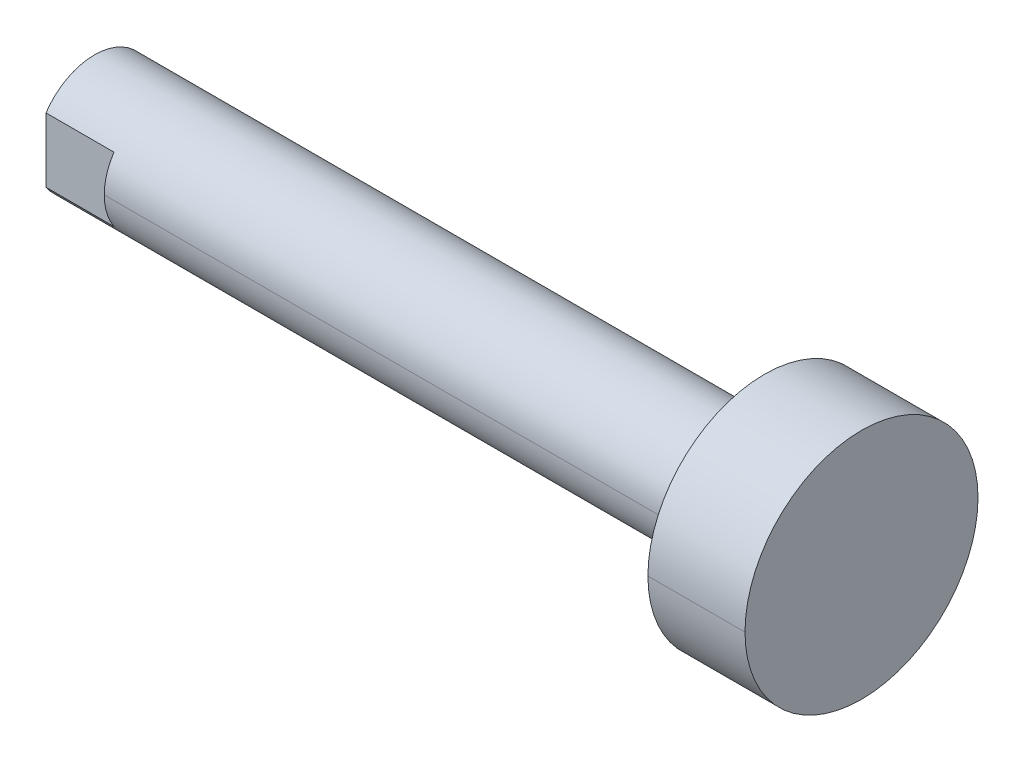
ISO-10303-21;
HEADER;
FILE_DESCRIPTION(('STEP AP214'),'2;1');
FILE_NAME('part.step','',(''),(''),'','','');
FILE_SCHEMA(('AUTOMOTIVE_DESIGN { 1 0 10303 214 1 1 1 1 }'));
ENDSEC;
DATA;
#1=APPLICATION_CONTEXT('core data for automotive mechanical design processes');
#2=APPLICATION_PROTOCOL_DEFINITION('international standard','automotive_design',2000,#1);
#3=PRODUCT_CONTEXT('',#1,'mechanical');
#4=PRODUCT('Part','Part','',(#3));
#5=PRODUCT_RELATED_PRODUCT_CATEGORY('part','',(#4));
#6=PRODUCT_DEFINITION_FORMATION('','',#4);
#7=PRODUCT_DEFINITION_CONTEXT('part definition',#1,'design');
#8=PRODUCT_DEFINITION('design','',#6,#7);
#9=PRODUCT_DEFINITION_SHAPE('','',#8);
#10=(LENGTH_UNIT() NAMED_UNIT(*) SI_UNIT(.MILLI.,.METRE.));
#11=(NAMED_UNIT(*) PLANE_ANGLE_UNIT() SI_UNIT($,.RADIAN.));
#12=(NAMED_UNIT(*) SI_UNIT($,.STERADIAN.) SOLID_ANGLE_UNIT());
#13=UNCERTAINTY_MEASURE_WITH_UNIT(LENGTH_MEASURE(1.E-05),#10,'distance_accuracy_value','');
#14=(GEOMETRIC_REPRESENTATION_CONTEXT(3) GLOBAL_UNCERTAINTY_ASSIGNED_CONTEXT((#13)) GLOBAL_UNIT_ASSIGNED_CONTEXT((#10,
#11,#12)) REPRESENTATION_CONTEXT('',''));
#15=CARTESIAN_POINT('',(0.,0.,0.));
#16=DIRECTION('',(0.,0.,1.));
#17=DIRECTION('',(1.,0.,0.));
#18=AXIS2_PLACEMENT_3D('',#15,#16,#17);
#19=CARTESIAN_POINT('',(-3.5,0.,0.));
#20=DIRECTION('',(1.,0.,0.));
#21=DIRECTION('',(0.,0.,-1.));
#22=AXIS2_PLACEMENT_3D('',#19,#20,#21);
#23=PLANE('',#22);
#24=CARTESIAN_POINT('',(-3.5,0.,0.));
#25=DIRECTION('',(1.,0.,0.));
#26=DIRECTION('',(0.,0.,-1.));
#27=AXIS2_PLACEMENT_3D('',#24,#25,#26);
#28=CIRCLE('',#27,3.);
#29=CARTESIAN_POINT('',(-3.5,1.6583123951777,-2.5));
#30=VERTEX_POINT('',#29);
#31=CARTESIAN_POINT('',(-3.5,1.6583123951777,2.5));
#32=VERTEX_POINT('',#31);
#33=EDGE_CURVE('E11',#30,#32,#28,.T.);
#34=ORIENTED_EDGE('',*,*,#33,.F.);
#35=DIRECTION('',(0.,1.,0.));
#36=VECTOR('',#35,1.);
#37=CARTESIAN_POINT('',(-3.5,-4.,-2.5));
#38=LINE('',#37,#36);
#39=CARTESIAN_POINT('',(-3.5,-1.6583123951777,-2.5));
#40=VERTEX_POINT('',#39);
#41=EDGE_CURVE('E25',#40,#30,#38,.T.);
#42=ORIENTED_EDGE('',*,*,#41,.F.);
#43=CARTESIAN_POINT('',(-3.5,0.,0.));
#44=DIRECTION('',(1.,0.,0.));
#45=DIRECTION('',(0.,0.,-1.));
#46=AXIS2_PLACEMENT_3D('',#43,#44,#45);
#47=CIRCLE('',#46,3.);
#48=CARTESIAN_POINT('',(-3.5,-1.6583123951777,2.5));
#49=VERTEX_POINT('',#48);
#50=EDGE_CURVE('E259',#49,#40,#47,.T.);
#51=ORIENTED_EDGE('',*,*,#50,.F.);
#52=DIRECTION('',(0.,-1.,0.));
#53=VECTOR('',#52,1.);
#54=CARTESIAN_POINT('',(-3.5,4.,2.5));
#55=LINE('',#54,#53);
#56=EDGE_CURVE('E254',#32,#49,#55,.T.);
#57=ORIENTED_EDGE('',*,*,#56,.F.);
#58=EDGE_LOOP('',(#34,#42,#51,#57));
#59=FACE_BOUND('',#58,.T.);
#60=CARTESIAN_POINT('',(-3.5,0.,0.));
#61=DIRECTION('',(1.,0.,0.));
#62=DIRECTION('',(0.,0.,-1.));
#63=AXIS2_PLACEMENT_3D('',#60,#61,#62);
#64=CIRCLE('',#63,1.5);
#65=CARTESIAN_POINT('',(-3.5,0.,-1.4999999999999));
#66=VERTEX_POINT('',#65);
#67=CARTESIAN_POINT('',(-3.5,0.,1.5));
#68=VERTEX_POINT('',#67);
#69=EDGE_CURVE('E250',#66,#68,#64,.T.);
#70=ORIENTED_EDGE('',*,*,#69,.T.);
#71=CARTESIAN_POINT('',(-3.5,0.,0.));
#72=DIRECTION('',(1.,0.,0.));
#73=DIRECTION('',(0.,0.,-1.));
#74=AXIS2_PLACEMENT_3D('',#71,#72,#73);
#75=CIRCLE('',#74,1.5);
#76=EDGE_CURVE('E246',#68,#66,#75,.T.);
#77=ORIENTED_EDGE('',*,*,#76,.T.);
#78=EDGE_LOOP('',(#70,#77));
#79=FACE_BOUND('',#78,.T.);
#80=ADVANCED_FACE('F17',(#59,#79),#23,.F.);
#81=CARTESIAN_POINT('',(-3.5,0.,0.));
#82=DIRECTION('',(-1.,0.,0.));
#83=DIRECTION('',(0.,1.,0.));
#84=AXIS2_PLACEMENT_3D('',#81,#82,#83);
#85=CONICAL_SURFACE('',#84,1.5,0.7853981634);
#86=ORIENTED_EDGE('',*,*,#76,.F.);
#87=DIRECTION('',(-0.707106781184744,0.,0.707106781188351));
#88=VECTOR('',#87,1.);
#89=CARTESIAN_POINT('',(-3.22950000000074,0.,1.22949999999936));
#90=LINE('',#89,#88);
#91=CARTESIAN_POINT('',(-3.22950000000074,0.,1.22949999999936));
#92=VERTEX_POINT('',#91);
#93=EDGE_CURVE('E241',#92,#68,#90,.T.);
#94=ORIENTED_EDGE('',*,*,#93,.F.);
#95=CARTESIAN_POINT('',(-3.2295000000001,0.,0.));
#96=DIRECTION('',(1.,0.,0.));
#97=DIRECTION('',(0.,0.,-1.));
#98=AXIS2_PLACEMENT_3D('',#95,#96,#97);
#99=CIRCLE('',#98,1.2295);
#100=CARTESIAN_POINT('',(-3.2295000000001,0.,-1.2295));
#101=VERTEX_POINT('',#100);
#102=EDGE_CURVE('E237',#92,#101,#99,.T.);
#103=ORIENTED_EDGE('',*,*,#102,.T.);
#104=DIRECTION('',(-0.707106781184744,0.,-0.707106781188351));
#105=VECTOR('',#104,1.);
#106=CARTESIAN_POINT('',(-3.22950000000074,0.,-1.22949999999936));
#107=LINE('',#106,#105);
#108=EDGE_CURVE('E232',#101,#66,#107,.T.);
#109=ORIENTED_EDGE('',*,*,#108,.T.);
#110=EDGE_LOOP('',(#86,#94,#103,#109));
#111=FACE_BOUND('',#110,.T.);
#112=ADVANCED_FACE('F295',(#111),#85,.F.);
#113=CARTESIAN_POINT('',(-3.5,0.,0.));
#114=DIRECTION('',(-1.,0.,0.));
#115=DIRECTION('',(0.,-1.,0.));
#116=AXIS2_PLACEMENT_3D('',#113,#114,#115);
#117=CONICAL_SURFACE('',#116,1.5,0.7853981634);
#118=CARTESIAN_POINT('',(-3.2295000000001,0.,0.));
#119=DIRECTION('',(1.,0.,0.));
#120=DIRECTION('',(0.,0.,-1.));
#121=AXIS2_PLACEMENT_3D('',#118,#119,#120);
#122=CIRCLE('',#121,1.2295);
#123=EDGE_CURVE('E227',#101,#92,#122,.T.);
#124=ORIENTED_EDGE('',*,*,#123,.T.);
#125=ORIENTED_EDGE('',*,*,#93,.T.);
#126=ORIENTED_EDGE('',*,*,#69,.F.);
#127=ORIENTED_EDGE('',*,*,#108,.F.);
#128=EDGE_LOOP('',(#124,#125,#126,#127));
#129=FACE_BOUND('',#128,.T.);
#130=ADVANCED_FACE('F299',(#129),#117,.F.);
#131=CARTESIAN_POINT('',(3.2098521559686,0.,0.));
#132=DIRECTION('',(-1.,0.,0.));
#133=DIRECTION('',(0.,-1.,0.));
#134=AXIS2_PLACEMENT_3D('',#131,#132,#133);
#135=CYLINDRICAL_SURFACE('',#134,1.2295);
#136=CARTESIAN_POINT('',(2.5,0.,0.));
#137=DIRECTION('',(1.,0.,0.));
#138=DIRECTION('',(0.,0.,-1.));
#139=AXIS2_PLACEMENT_3D('',#136,#137,#138);
#140=CIRCLE('',#139,1.2295);
#141=CARTESIAN_POINT('',(2.5,0.,-1.2295));
#142=VERTEX_POINT('',#141);
#143=CARTESIAN_POINT('',(2.5,0.,1.2295));
#144=VERTEX_POINT('',#143);
#145=EDGE_CURVE('E223',#142,#144,#140,.T.);
#146=ORIENTED_EDGE('',*,*,#145,.T.);
#147=DIRECTION('',(-1.,0.,0.));
#148=VECTOR('',#147,1.);
#149=CARTESIAN_POINT('',(2.5,0.,1.2295));
#150=LINE('',#149,#148);
#151=EDGE_CURVE('E218',#144,#92,#150,.T.);
#152=ORIENTED_EDGE('',*,*,#151,.T.);
#153=ORIENTED_EDGE('',*,*,#123,.F.);
#154=DIRECTION('',(-1.,0.,0.));
#155=VECTOR('',#154,1.);
#156=CARTESIAN_POINT('',(2.5,0.,-1.2295));
#157=LINE('',#156,#155);
#158=EDGE_CURVE('E213',#142,#101,#157,.T.);
#159=ORIENTED_EDGE('',*,*,#158,.F.);
#160=EDGE_LOOP('',(#146,#152,#153,#159));
#161=FACE_BOUND('',#160,.T.);
#162=ADVANCED_FACE('F310',(#161),#135,.F.);
#163=CARTESIAN_POINT('',(3.2098521559686,0.,0.));
#164=DIRECTION('',(-1.,0.,0.));
#165=DIRECTION('',(0.,1.,0.));
#166=AXIS2_PLACEMENT_3D('',#163,#164,#165);
#167=CYLINDRICAL_SURFACE('',#166,1.2295);
#168=ORIENTED_EDGE('',*,*,#102,.F.);
#169=ORIENTED_EDGE('',*,*,#151,.F.);
#170=CARTESIAN_POINT('',(2.5,0.,0.));
#171=DIRECTION('',(1.,0.,0.));
#172=DIRECTION('',(0.,0.,-1.));
#173=AXIS2_PLACEMENT_3D('',#170,#171,#172);
#174=CIRCLE('',#173,1.2295);
#175=EDGE_CURVE('E208',#144,#142,#174,.T.);
#176=ORIENTED_EDGE('',*,*,#175,.T.);
#177=ORIENTED_EDGE('',*,*,#158,.T.);
#178=EDGE_LOOP('',(#168,#169,#176,#177));
#179=FACE_BOUND('',#178,.T.);
#180=ADVANCED_FACE('F314',(#179),#167,.F.);
#181=CARTESIAN_POINT('',(2.5,0.,0.));
#182=DIRECTION('',(-1.,0.,0.));
#183=DIRECTION('',(0.,1.,0.));
#184=AXIS2_PLACEMENT_3D('',#181,#182,#183);
#185=CONICAL_SURFACE('',#184,1.2295,1.0471975512);
#186=DIRECTION('',(-0.499999999997054,0.,-0.86602540378614));
#187=VECTOR('',#186,1.);
#188=CARTESIAN_POINT('',(3.20985215596307,0.,0.));
#189=LINE('',#188,#187);
#190=CARTESIAN_POINT('',(3.2098521559686,0.,0.));
#191=VERTEX_POINT('',#190);
#192=EDGE_CURVE('E203',#191,#142,#189,.T.);
#193=ORIENTED_EDGE('',*,*,#192,.T.);
#194=ORIENTED_EDGE('',*,*,#175,.F.);
#195=DIRECTION('',(-0.499999999997054,0.,0.86602540378614));
#196=VECTOR('',#195,1.);
#197=CARTESIAN_POINT('',(3.20985215596307,0.,0.));
#198=LINE('',#197,#196);
#199=EDGE_CURVE('E198',#191,#144,#198,.T.);
#200=ORIENTED_EDGE('',*,*,#199,.F.);
#201=EDGE_LOOP('',(#193,#194,#200));
#202=FACE_BOUND('',#201,.T.);
#203=ADVANCED_FACE('F317',(#202),#185,.F.);
#204=CARTESIAN_POINT('',(2.5,0.,0.));
#205=DIRECTION('',(-1.,0.,0.));
#206=DIRECTION('',(0.,-1.,0.));
#207=AXIS2_PLACEMENT_3D('',#204,#205,#206);
#208=CONICAL_SURFACE('',#207,1.2295,1.0471975512);
#209=ORIENTED_EDGE('',*,*,#199,.T.);
#210=ORIENTED_EDGE('',*,*,#145,.F.);
#211=ORIENTED_EDGE('',*,*,#192,.F.);
#212=EDGE_LOOP('',(#209,#210,#211));
#213=FACE_BOUND('',#212,.T.);
#214=ADVANCED_FACE('F319',(#213),#208,.F.);
#215=CARTESIAN_POINT('',(-3.5,4.,2.5));
#216=DIRECTION('',(0.,0.,1.));
#217=DIRECTION('',(1.,0.,0.));
#218=AXIS2_PLACEMENT_3D('',#215,#216,#217);
#219=PLANE('',#218);
#220=DIRECTION('',(1.,0.,0.));
#221=VECTOR('',#220,1.);
#222=CARTESIAN_POINT('',(36.,-1.6583123951777,2.5));
#223=LINE('',#222,#221);
#224=CARTESIAN_POINT('',(0.,-1.6583123951777,2.5));
#225=VERTEX_POINT('',#224);
#226=EDGE_CURVE('E194',#49,#225,#223,.T.);
#227=ORIENTED_EDGE('',*,*,#226,.T.);
#228=DIRECTION('',(0.,-1.,0.));
#229=VECTOR('',#228,1.);
#230=CARTESIAN_POINT('',(0.,4.,2.5));
#231=LINE('',#230,#229);
#232=CARTESIAN_POINT('',(0.,1.6583123951777,2.5));
#233=VERTEX_POINT('',#232);
#234=EDGE_CURVE('E189',#233,#225,#231,.T.);
#235=ORIENTED_EDGE('',*,*,#234,.F.);
#236=DIRECTION('',(1.,0.,0.));
#237=VECTOR('',#236,1.);
#238=CARTESIAN_POINT('',(36.,1.6583123951777,2.5));
#239=LINE('',#238,#237);
#240=EDGE_CURVE('E184',#32,#233,#239,.T.);
#241=ORIENTED_EDGE('',*,*,#240,.F.);
#242=ORIENTED_EDGE('',*,*,#56,.T.);
#243=EDGE_LOOP('',(#227,#235,#241,#242));
#244=FACE_BOUND('',#243,.T.);
#245=ADVANCED_FACE('F321',(#244),#219,.T.);
#246=CARTESIAN_POINT('',(36.,0.,0.));
#247=DIRECTION('',(-1.,0.,0.));
#248=DIRECTION('',(0.,-1.,0.));
#249=AXIS2_PLACEMENT_3D('',#246,#247,#248);
#250=CYLINDRICAL_SURFACE('',#249,3.);
#251=CARTESIAN_POINT('',(31.,0.,0.));
#252=DIRECTION('',(1.,0.,0.));
#253=DIRECTION('',(0.,0.,-1.));
#254=AXIS2_PLACEMENT_3D('',#251,#252,#253);
#255=CIRCLE('',#254,3.);
#256=CARTESIAN_POINT('',(31.,0.,-3.));
#257=VERTEX_POINT('',#256);
#258=CARTESIAN_POINT('',(31.,0.,3.));
#259=VERTEX_POINT('',#258);
#260=EDGE_CURVE('E179',#257,#259,#255,.T.);
#261=ORIENTED_EDGE('',*,*,#260,.F.);
#262=DIRECTION('',(-1.,0.,0.));
#263=VECTOR('',#262,1.);
#264=CARTESIAN_POINT('',(31.,0.,-3.));
#265=LINE('',#264,#263);
#266=CARTESIAN_POINT('',(0.,0.,-3.));
#267=VERTEX_POINT('',#266);
#268=EDGE_CURVE('E175',#257,#267,#265,.T.);
#269=ORIENTED_EDGE('',*,*,#268,.T.);
#270=CARTESIAN_POINT('',(0.,0.,0.));
#271=DIRECTION('',(1.,0.,0.));
#272=DIRECTION('',(0.,0.,-1.));
#273=AXIS2_PLACEMENT_3D('',#270,#271,#272);
#274=CIRCLE('',#273,3.);
#275=CARTESIAN_POINT('',(0.,1.6583123951777,-2.5));
#276=VERTEX_POINT('',#275);
#277=EDGE_CURVE('E171',#267,#276,#274,.T.);
#278=ORIENTED_EDGE('',*,*,#277,.T.);
#279=DIRECTION('',(1.,0.,0.));
#280=VECTOR('',#279,1.);
#281=CARTESIAN_POINT('',(36.,1.6583123951777,-2.5));
#282=LINE('',#281,#280);
#283=EDGE_CURVE('E166',#30,#276,#282,.T.);
#284=ORIENTED_EDGE('',*,*,#283,.F.);
#285=ORIENTED_EDGE('',*,*,#33,.T.);
#286=ORIENTED_EDGE('',*,*,#240,.T.);
#287=CARTESIAN_POINT('',(0.,0.,0.));
#288=DIRECTION('',(1.,0.,0.));
#289=DIRECTION('',(0.,0.,-1.));
#290=AXIS2_PLACEMENT_3D('',#287,#288,#289);
#291=CIRCLE('',#290,3.);
#292=CARTESIAN_POINT('',(0.,0.,3.));
#293=VERTEX_POINT('',#292);
#294=EDGE_CURVE('E162',#233,#293,#291,.T.);
#295=ORIENTED_EDGE('',*,*,#294,.T.);
#296=DIRECTION('',(-1.,0.,0.));
#297=VECTOR('',#296,1.);
#298=CARTESIAN_POINT('',(31.,0.,3.));
#299=LINE('',#298,#297);
#300=EDGE_CURVE('E157',#259,#293,#299,.T.);
#301=ORIENTED_EDGE('',*,*,#300,.F.);
#302=EDGE_LOOP('',(#261,#269,#278,#284,#285,#286,#295,#301));
#303=FACE_BOUND('',#302,.T.);
#304=ADVANCED_FACE('F280',(#303),#250,.T.);
#305=CARTESIAN_POINT('',(36.,0.,0.));
#306=DIRECTION('',(-1.,0.,0.));
#307=DIRECTION('',(0.,1.,0.));
#308=AXIS2_PLACEMENT_3D('',#305,#306,#307);
#309=CYLINDRICAL_SURFACE('',#308,3.);
#310=CARTESIAN_POINT('',(0.,0.,0.));
#311=DIRECTION('',(1.,0.,0.));
#312=DIRECTION('',(0.,0.,-1.));
#313=AXIS2_PLACEMENT_3D('',#310,#311,#312);
#314=CIRCLE('',#313,3.);
#315=EDGE_CURVE('E152',#293,#225,#314,.T.);
#316=ORIENTED_EDGE('',*,*,#315,.T.);
#317=ORIENTED_EDGE('',*,*,#226,.F.);
#318=ORIENTED_EDGE('',*,*,#50,.T.);
#319=DIRECTION('',(1.,0.,0.));
#320=VECTOR('',#319,1.);
#321=CARTESIAN_POINT('',(36.,-1.6583123951777,-2.5));
#322=LINE('',#321,#320);
#323=CARTESIAN_POINT('',(0.,-1.6583123951777,-2.5));
#324=VERTEX_POINT('',#323);
#325=EDGE_CURVE('E148',#40,#324,#322,.T.);
#326=ORIENTED_EDGE('',*,*,#325,.T.);
#327=CARTESIAN_POINT('',(0.,0.,0.));
#328=DIRECTION('',(1.,0.,0.));
#329=DIRECTION('',(0.,0.,-1.));
#330=AXIS2_PLACEMENT_3D('',#327,#328,#329);
#331=CIRCLE('',#330,3.);
#332=EDGE_CURVE('E143',#324,#267,#331,.T.);
#333=ORIENTED_EDGE('',*,*,#332,.T.);
#334=ORIENTED_EDGE('',*,*,#268,.F.);
#335=CARTESIAN_POINT('',(31.,0.,0.));
#336=DIRECTION('',(1.,0.,0.));
#337=DIRECTION('',(0.,0.,-1.));
#338=AXIS2_PLACEMENT_3D('',#335,#336,#337);
#339=CIRCLE('',#338,3.);
#340=EDGE_CURVE('E138',#259,#257,#339,.T.);
#341=ORIENTED_EDGE('',*,*,#340,.F.);
#342=ORIENTED_EDGE('',*,*,#300,.T.);
#343=EDGE_LOOP('',(#316,#317,#318,#326,#333,#334,#341,#342));
#344=FACE_BOUND('',#343,.T.);
#345=ADVANCED_FACE('F273',(#344),#309,.T.);
#346=CARTESIAN_POINT('',(31.,3.,0.));
#347=DIRECTION('',(1.,0.,0.));
#348=DIRECTION('',(0.,0.,-1.));
#349=AXIS2_PLACEMENT_3D('',#346,#347,#348);
#350=PLANE('',#349);
#351=CARTESIAN_POINT('',(31.,0.,0.));
#352=DIRECTION('',(1.,0.,0.));
#353=DIRECTION('',(0.,0.,-1.));
#354=AXIS2_PLACEMENT_3D('',#351,#352,#353);
#355=CIRCLE('',#354,6.);
#356=CARTESIAN_POINT('',(31.,0.,-6.));
#357=VERTEX_POINT('',#356);
#358=CARTESIAN_POINT('',(31.,0.,6.));
#359=VERTEX_POINT('',#358);
#360=EDGE_CURVE('E114',#357,#359,#355,.T.);
#361=ORIENTED_EDGE('',*,*,#360,.F.);
#362=CARTESIAN_POINT('',(31.,0.,0.));
#363=DIRECTION('',(1.,0.,0.));
#364=DIRECTION('',(0.,0.,-1.));
#365=AXIS2_PLACEMENT_3D('',#362,#363,#364);
#366=CIRCLE('',#365,6.);
#367=EDGE_CURVE('E131',#359,#357,#366,.T.);
#368=ORIENTED_EDGE('',*,*,#367,.F.);
#369=EDGE_LOOP('',(#361,#368));
#370=FACE_BOUND('',#369,.T.);
#371=ORIENTED_EDGE('',*,*,#260,.T.);
#372=ORIENTED_EDGE('',*,*,#340,.T.);
#373=EDGE_LOOP('',(#371,#372));
#374=FACE_BOUND('',#373,.T.);
#375=ADVANCED_FACE('F283',(#370,#374),#350,.F.);
#376=CARTESIAN_POINT('',(36.,0.,0.));
#377=DIRECTION('',(-1.,0.,0.));
#378=DIRECTION('',(0.,1.,0.));
#379=AXIS2_PLACEMENT_3D('',#376,#377,#378);
#380=CYLINDRICAL_SURFACE('',#379,6.);
#381=ORIENTED_EDGE('',*,*,#367,.T.);
#382=DIRECTION('',(-1.,0.,0.));
#383=VECTOR('',#382,1.);
#384=CARTESIAN_POINT('',(36.,0.,-6.));
#385=LINE('',#384,#383);
#386=CARTESIAN_POINT('',(36.,0.,-6.));
#387=VERTEX_POINT('',#386);
#388=EDGE_CURVE('E106',#387,#357,#385,.T.);
#389=ORIENTED_EDGE('',*,*,#388,.F.);
#390=CARTESIAN_POINT('',(36.,0.,0.));
#391=DIRECTION('',(1.,0.,0.));
#392=DIRECTION('',(0.,0.,-1.));
#393=AXIS2_PLACEMENT_3D('',#390,#391,#392);
#394=CIRCLE('',#393,6.);
#395=CARTESIAN_POINT('',(36.,0.,6.));
#396=VERTEX_POINT('',#395);
#397=EDGE_CURVE('E99',#396,#387,#394,.T.);
#398=ORIENTED_EDGE('',*,*,#397,.F.);
#399=DIRECTION('',(-1.,0.,0.));
#400=VECTOR('',#399,1.);
#401=CARTESIAN_POINT('',(36.,0.,6.));
#402=LINE('',#401,#400);
#403=EDGE_CURVE('E103',#396,#359,#402,.T.);
#404=ORIENTED_EDGE('',*,*,#403,.T.);
#405=EDGE_LOOP('',(#381,#389,#398,#404));
#406=FACE_BOUND('',#405,.T.);
#407=ADVANCED_FACE('F102',(#406),#380,.T.);
#408=CARTESIAN_POINT('',(36.,0.,0.));
#409=DIRECTION('',(-1.,0.,0.));
#410=DIRECTION('',(0.,-1.,0.));
#411=AXIS2_PLACEMENT_3D('',#408,#409,#410);
#412=CYLINDRICAL_SURFACE('',#411,6.);
#413=CARTESIAN_POINT('',(36.,0.,0.));
#414=DIRECTION('',(1.,0.,0.));
#415=DIRECTION('',(0.,0.,-1.));
#416=AXIS2_PLACEMENT_3D('',#413,#414,#415);
#417=CIRCLE('',#416,6.);
#418=EDGE_CURVE('E113',#387,#396,#417,.T.);
#419=ORIENTED_EDGE('',*,*,#418,.F.);
#420=ORIENTED_EDGE('',*,*,#388,.T.);
#421=ORIENTED_EDGE('',*,*,#360,.T.);
#422=ORIENTED_EDGE('',*,*,#403,.F.);
#423=EDGE_LOOP('',(#419,#420,#421,#422));
#424=FACE_BOUND('',#423,.T.);
#425=ADVANCED_FACE('F112',(#424),#412,.T.);
#426=CARTESIAN_POINT('',(36.,6.,0.));
#427=DIRECTION('',(-1.,0.,0.));
#428=DIRECTION('',(0.,0.,1.));
#429=AXIS2_PLACEMENT_3D('',#426,#427,#428);
#430=PLANE('',#429);
#431=ORIENTED_EDGE('',*,*,#418,.T.);
#432=ORIENTED_EDGE('',*,*,#397,.T.);
#433=EDGE_LOOP('',(#431,#432));
#434=FACE_BOUND('',#433,.T.);
#435=ADVANCED_FACE('F116',(#434),#430,.F.);
#436=CARTESIAN_POINT('',(0.,0.,0.));
#437=DIRECTION('',(1.,0.,0.));
#438=DIRECTION('',(0.,0.,-1.));
#439=AXIS2_PLACEMENT_3D('',#436,#437,#438);
#440=PLANE('',#439);
#441=DIRECTION('',(0.,1.,0.));
#442=VECTOR('',#441,1.);
#443=CARTESIAN_POINT('',(0.,-4.,-2.5));
#444=LINE('',#443,#442);
#445=EDGE_CURVE('E117',#324,#276,#444,.T.);
#446=ORIENTED_EDGE('',*,*,#445,.T.);
#447=ORIENTED_EDGE('',*,*,#277,.F.);
#448=ORIENTED_EDGE('',*,*,#332,.F.);
#449=EDGE_LOOP('',(#446,#447,#448));
#450=FACE_BOUND('',#449,.T.);
#451=ADVANCED_FACE('F278',(#450),#440,.F.);
#452=CARTESIAN_POINT('',(-3.5,-4.,-2.5));
#453=DIRECTION('',(0.,0.,-1.));
#454=DIRECTION('',(-1.,0.,0.));
#455=AXIS2_PLACEMENT_3D('',#452,#453,#454);
#456=PLANE('',#455);
#457=ORIENTED_EDGE('',*,*,#283,.T.);
#458=ORIENTED_EDGE('',*,*,#445,.F.);
#459=ORIENTED_EDGE('',*,*,#325,.F.);
#460=ORIENTED_EDGE('',*,*,#41,.T.);
#461=EDGE_LOOP('',(#457,#458,#459,#460));
#462=FACE_BOUND('',#461,.T.);
#463=ADVANCED_FACE('F269',(#462),#456,.T.);
#464=CARTESIAN_POINT('',(0.,0.,0.));
#465=DIRECTION('',(1.,0.,0.));
#466=DIRECTION('',(0.,0.,-1.));
#467=AXIS2_PLACEMENT_3D('',#464,#465,#466);
#468=PLANE('',#467);
#469=ORIENTED_EDGE('',*,*,#234,.T.);
#470=ORIENTED_EDGE('',*,*,#315,.F.);
#471=ORIENTED_EDGE('',*,*,#294,.F.);
#472=EDGE_LOOP('',(#469,#470,#471));
#473=FACE_BOUND('',#472,.T.);
#474=ADVANCED_FACE('F410',(#473),#468,.F.);
#475=CLOSED_SHELL('',(#80,#112,#130,#162,#180,#203,#214,#245,#304,#345,#375,#407,#425,#435,#451,
#463,#474));
#476=MANIFOLD_SOLID_BREP('B1',#475);
#477=ADVANCED_BREP_SHAPE_REPRESENTATION('',(#18,#476),#14);
#478=SHAPE_DEFINITION_REPRESENTATION(#9,#477);
ENDSEC;
END-ISO-10303-21;
